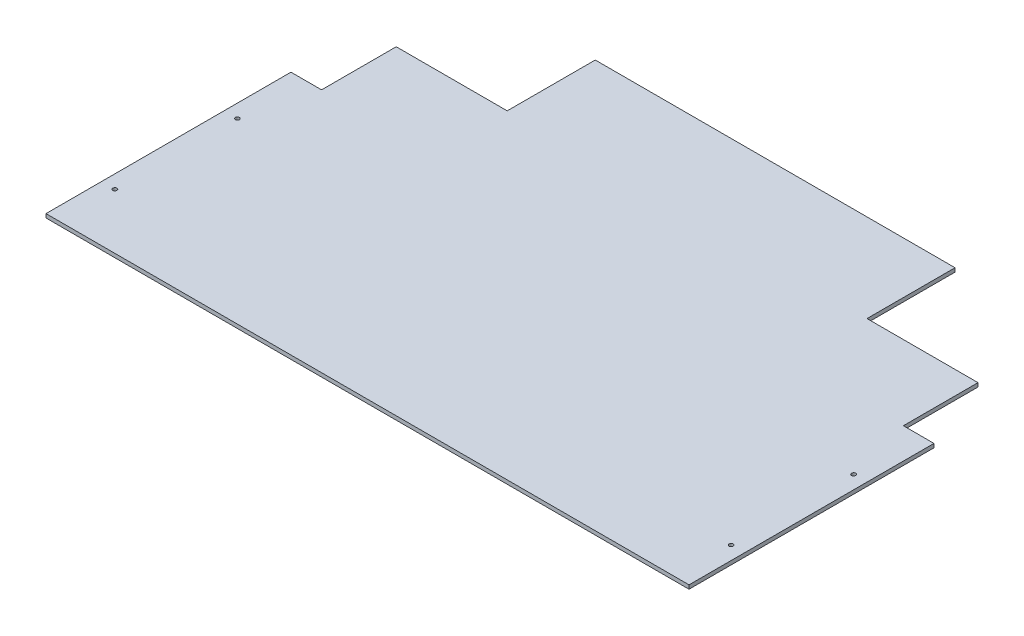
ISO-10303-21;
HEADER;
FILE_DESCRIPTION(('STEP AP214'),'2;1');
FILE_NAME('part.step','',(''),(''),'','','');
FILE_SCHEMA(('AUTOMOTIVE_DESIGN { 1 0 10303 214 1 1 1 1 }'));
ENDSEC;
DATA;
#1=APPLICATION_CONTEXT('core data for automotive mechanical design processes');
#2=APPLICATION_PROTOCOL_DEFINITION('international standard','automotive_design',2000,#1);
#3=PRODUCT_CONTEXT('',#1,'mechanical');
#4=PRODUCT('Part','Part','',(#3));
#5=PRODUCT_RELATED_PRODUCT_CATEGORY('part','',(#4));
#6=PRODUCT_DEFINITION_FORMATION('','',#4);
#7=PRODUCT_DEFINITION_CONTEXT('part definition',#1,'design');
#8=PRODUCT_DEFINITION('design','',#6,#7);
#9=PRODUCT_DEFINITION_SHAPE('','',#8);
#10=(LENGTH_UNIT() NAMED_UNIT(*) SI_UNIT(.MILLI.,.METRE.));
#11=(NAMED_UNIT(*) PLANE_ANGLE_UNIT() SI_UNIT($,.RADIAN.));
#12=(NAMED_UNIT(*) SI_UNIT($,.STERADIAN.) SOLID_ANGLE_UNIT());
#13=UNCERTAINTY_MEASURE_WITH_UNIT(LENGTH_MEASURE(1.E-05),#10,'distance_accuracy_value','');
#14=(GEOMETRIC_REPRESENTATION_CONTEXT(3) GLOBAL_UNCERTAINTY_ASSIGNED_CONTEXT((#13)) GLOBAL_UNIT_ASSIGNED_CONTEXT((#10,
#11,#12)) REPRESENTATION_CONTEXT('',''));
#15=CARTESIAN_POINT('',(0.,0.,0.));
#16=DIRECTION('',(0.,0.,1.));
#17=DIRECTION('',(1.,0.,0.));
#18=AXIS2_PLACEMENT_3D('',#15,#16,#17);
#19=CARTESIAN_POINT('',(0.,6.35,0.));
#20=DIRECTION('',(0.,-1.,0.));
#21=DIRECTION('',(0.,0.,-1.));
#22=AXIS2_PLACEMENT_3D('',#19,#20,#21);
#23=PLANE('',#22);
#24=DIRECTION('',(0.,0.,1.));
#25=VECTOR('',#24,1.);
#26=CARTESIAN_POINT('',(0.,6.35,0.));
#27=LINE('',#26,#25);
#28=CARTESIAN_POINT('',(0.,6.35,-406.4));
#29=VERTEX_POINT('',#28);
#30=CARTESIAN_POINT('',(0.,6.35,0.));
#31=VERTEX_POINT('',#30);
#32=EDGE_CURVE('E181',#29,#31,#27,.T.);
#33=ORIENTED_EDGE('',*,*,#32,.T.);
#34=DIRECTION('',(1.,0.,0.));
#35=VECTOR('',#34,1.);
#36=CARTESIAN_POINT('',(0.,6.35,0.));
#37=LINE('',#36,#35);
#38=CARTESIAN_POINT('',(1066.8,6.35,0.));
#39=VERTEX_POINT('',#38);
#40=EDGE_CURVE('E109',#31,#39,#37,.T.);
#41=ORIENTED_EDGE('',*,*,#40,.T.);
#42=DIRECTION('',(0.,0.,-1.));
#43=VECTOR('',#42,1.);
#44=CARTESIAN_POINT('',(1066.8,6.35,0.));
#45=LINE('',#44,#43);
#46=CARTESIAN_POINT('',(1066.8,6.35,-406.4));
#47=VERTEX_POINT('',#46);
#48=EDGE_CURVE('E208',#39,#47,#45,.T.);
#49=ORIENTED_EDGE('',*,*,#48,.T.);
#50=DIRECTION('',(-1.,0.,0.));
#51=VECTOR('',#50,1.);
#52=CARTESIAN_POINT('',(1016.,6.35,-406.4));
#53=LINE('',#52,#51);
#54=CARTESIAN_POINT('',(1016.,6.35,-406.4));
#55=VERTEX_POINT('',#54);
#56=EDGE_CURVE('E227',#47,#55,#53,.T.);
#57=ORIENTED_EDGE('',*,*,#56,.T.);
#58=DIRECTION('',(0.,0.,-1.));
#59=VECTOR('',#58,1.);
#60=CARTESIAN_POINT('',(1016.,6.35,-406.4));
#61=LINE('',#60,#59);
#62=CARTESIAN_POINT('',(1016.,6.35,-530.225));
#63=VERTEX_POINT('',#62);
#64=EDGE_CURVE('E224',#55,#63,#61,.T.);
#65=ORIENTED_EDGE('',*,*,#64,.T.);
#66=DIRECTION('',(-1.,0.,0.));
#67=VECTOR('',#66,1.);
#68=CARTESIAN_POINT('',(831.85,6.35,-530.225));
#69=LINE('',#68,#67);
#70=CARTESIAN_POINT('',(831.85,6.35,-530.225));
#71=VERTEX_POINT('',#70);
#72=EDGE_CURVE('E226',#63,#71,#69,.T.);
#73=ORIENTED_EDGE('',*,*,#72,.T.);
#74=DIRECTION('',(0.,0.,-1.));
#75=VECTOR('',#74,1.);
#76=CARTESIAN_POINT('',(831.85,6.35,-530.225));
#77=LINE('',#76,#75);
#78=CARTESIAN_POINT('',(831.85,6.35,-676.275));
#79=VERTEX_POINT('',#78);
#80=EDGE_CURVE('E229',#71,#79,#77,.T.);
#81=ORIENTED_EDGE('',*,*,#80,.T.);
#82=DIRECTION('',(-1.,0.,0.));
#83=VECTOR('',#82,1.);
#84=CARTESIAN_POINT('',(234.95,6.35,-676.275));
#85=LINE('',#84,#83);
#86=CARTESIAN_POINT('',(234.95,6.35,-676.275));
#87=VERTEX_POINT('',#86);
#88=EDGE_CURVE('E235',#79,#87,#85,.T.);
#89=ORIENTED_EDGE('',*,*,#88,.T.);
#90=DIRECTION('',(0.,0.,1.));
#91=VECTOR('',#90,1.);
#92=CARTESIAN_POINT('',(234.95,6.35,-530.225));
#93=LINE('',#92,#91);
#94=CARTESIAN_POINT('',(234.95,6.35,-530.225));
#95=VERTEX_POINT('',#94);
#96=EDGE_CURVE('E140',#87,#95,#93,.T.);
#97=ORIENTED_EDGE('',*,*,#96,.T.);
#98=DIRECTION('',(-1.,0.,0.));
#99=VECTOR('',#98,1.);
#100=CARTESIAN_POINT('',(234.95,6.35,-530.225));
#101=LINE('',#100,#99);
#102=CARTESIAN_POINT('',(50.8,6.35,-530.225));
#103=VERTEX_POINT('',#102);
#104=EDGE_CURVE('E134',#95,#103,#101,.T.);
#105=ORIENTED_EDGE('',*,*,#104,.T.);
#106=DIRECTION('',(0.,0.,1.));
#107=VECTOR('',#106,1.);
#108=CARTESIAN_POINT('',(50.8,6.35,-406.4));
#109=LINE('',#108,#107);
#110=CARTESIAN_POINT('',(50.8,6.35,-406.4));
#111=VERTEX_POINT('',#110);
#112=EDGE_CURVE('E138',#103,#111,#109,.T.);
#113=ORIENTED_EDGE('',*,*,#112,.T.);
#114=DIRECTION('',(-1.,0.,0.));
#115=VECTOR('',#114,1.);
#116=CARTESIAN_POINT('',(0.,6.35,-406.4));
#117=LINE('',#116,#115);
#118=EDGE_CURVE('E54',#111,#29,#117,.T.);
#119=ORIENTED_EDGE('',*,*,#118,.T.);
#120=EDGE_LOOP('',(#33,#41,#49,#57,#65,#73,#81,#89,#97,#105,#113,#119));
#121=FACE_BOUND('',#120,.T.);
#122=CARTESIAN_POINT('',(22.225,6.35,-295.275));
#123=DIRECTION('',(0.,1.,0.));
#124=DIRECTION('',(0.,0.,1.));
#125=AXIS2_PLACEMENT_3D('',#122,#123,#124);
#126=CIRCLE('',#125,3.3734375);
#127=CARTESIAN_POINT('',(22.225,6.35,-291.9015625));
#128=VERTEX_POINT('',#127);
#129=EDGE_CURVE('E162',#128,#128,#126,.T.);
#130=ORIENTED_EDGE('',*,*,#129,.F.);
#131=EDGE_LOOP('',(#130));
#132=FACE_BOUND('',#131,.T.);
#133=CARTESIAN_POINT('',(22.225,6.35,-92.075));
#134=DIRECTION('',(0.,1.,0.));
#135=DIRECTION('',(0.,0.,1.));
#136=AXIS2_PLACEMENT_3D('',#133,#134,#135);
#137=CIRCLE('',#136,3.3734375);
#138=CARTESIAN_POINT('',(22.225,6.35,-88.7015625));
#139=VERTEX_POINT('',#138);
#140=EDGE_CURVE('E299',#139,#139,#137,.T.);
#141=ORIENTED_EDGE('',*,*,#140,.F.);
#142=EDGE_LOOP('',(#141));
#143=FACE_BOUND('',#142,.T.);
#144=CARTESIAN_POINT('',(1044.575,6.35,-92.075));
#145=DIRECTION('',(0.,1.,0.));
#146=DIRECTION('',(0.,0.,1.));
#147=AXIS2_PLACEMENT_3D('',#144,#145,#146);
#148=CIRCLE('',#147,3.37343750000014);
#149=CARTESIAN_POINT('',(1044.575,6.35,-88.7015624999998));
#150=VERTEX_POINT('',#149);
#151=EDGE_CURVE('E293',#150,#150,#148,.T.);
#152=ORIENTED_EDGE('',*,*,#151,.F.);
#153=EDGE_LOOP('',(#152));
#154=FACE_BOUND('',#153,.T.);
#155=CARTESIAN_POINT('',(1044.575,6.35,-295.275));
#156=DIRECTION('',(0.,1.,0.));
#157=DIRECTION('',(0.,0.,1.));
#158=AXIS2_PLACEMENT_3D('',#155,#156,#157);
#159=CIRCLE('',#158,3.37343750000014);
#160=CARTESIAN_POINT('',(1044.575,6.35,-291.9015625));
#161=VERTEX_POINT('',#160);
#162=EDGE_CURVE('E284',#161,#161,#159,.T.);
#163=ORIENTED_EDGE('',*,*,#162,.F.);
#164=EDGE_LOOP('',(#163));
#165=FACE_BOUND('',#164,.T.);
#166=ADVANCED_FACE('F37',(#121,#132,#143,#154,#165),#23,.F.);
#167=CARTESIAN_POINT('',(0.,0.,0.));
#168=DIRECTION('',(0.,-1.,0.));
#169=DIRECTION('',(0.,0.,-1.));
#170=AXIS2_PLACEMENT_3D('',#167,#168,#169);
#171=PLANE('',#170);
#172=CARTESIAN_POINT('',(1044.575,0.,-92.075));
#173=DIRECTION('',(0.,1.,0.));
#174=DIRECTION('',(0.,0.,1.));
#175=AXIS2_PLACEMENT_3D('',#172,#173,#174);
#176=CIRCLE('',#175,3.37343750000014);
#177=CARTESIAN_POINT('',(1044.575,0.,-88.7015624999998));
#178=VERTEX_POINT('',#177);
#179=EDGE_CURVE('E290',#178,#178,#176,.T.);
#180=ORIENTED_EDGE('',*,*,#179,.T.);
#181=EDGE_LOOP('',(#180));
#182=FACE_BOUND('',#181,.T.);
#183=CARTESIAN_POINT('',(22.225,0.,-295.275));
#184=DIRECTION('',(0.,1.,0.));
#185=DIRECTION('',(0.,0.,1.));
#186=AXIS2_PLACEMENT_3D('',#183,#184,#185);
#187=CIRCLE('',#186,3.3734375);
#188=CARTESIAN_POINT('',(22.225,0.,-291.9015625));
#189=VERTEX_POINT('',#188);
#190=EDGE_CURVE('E302',#189,#189,#187,.T.);
#191=ORIENTED_EDGE('',*,*,#190,.T.);
#192=EDGE_LOOP('',(#191));
#193=FACE_BOUND('',#192,.T.);
#194=DIRECTION('',(0.,0.,1.));
#195=VECTOR('',#194,1.);
#196=CARTESIAN_POINT('',(0.,0.,0.));
#197=LINE('',#196,#195);
#198=CARTESIAN_POINT('',(0.,0.,-406.4));
#199=VERTEX_POINT('',#198);
#200=CARTESIAN_POINT('',(0.,0.,0.));
#201=VERTEX_POINT('',#200);
#202=EDGE_CURVE('E158',#199,#201,#197,.T.);
#203=ORIENTED_EDGE('',*,*,#202,.F.);
#204=DIRECTION('',(-1.,0.,0.));
#205=VECTOR('',#204,1.);
#206=CARTESIAN_POINT('',(0.,0.,-406.4));
#207=LINE('',#206,#205);
#208=CARTESIAN_POINT('',(50.8,0.,-406.4));
#209=VERTEX_POINT('',#208);
#210=EDGE_CURVE('E101',#209,#199,#207,.T.);
#211=ORIENTED_EDGE('',*,*,#210,.F.);
#212=DIRECTION('',(0.,0.,1.));
#213=VECTOR('',#212,1.);
#214=CARTESIAN_POINT('',(50.8,0.,-406.4));
#215=LINE('',#214,#213);
#216=CARTESIAN_POINT('',(50.8,0.,-530.225));
#217=VERTEX_POINT('',#216);
#218=EDGE_CURVE('E95',#217,#209,#215,.T.);
#219=ORIENTED_EDGE('',*,*,#218,.F.);
#220=DIRECTION('',(-1.,0.,0.));
#221=VECTOR('',#220,1.);
#222=CARTESIAN_POINT('',(234.95,0.,-530.225));
#223=LINE('',#222,#221);
#224=CARTESIAN_POINT('',(234.95,0.,-530.225));
#225=VERTEX_POINT('',#224);
#226=EDGE_CURVE('E148',#225,#217,#223,.T.);
#227=ORIENTED_EDGE('',*,*,#226,.F.);
#228=DIRECTION('',(0.,0.,1.));
#229=VECTOR('',#228,1.);
#230=CARTESIAN_POINT('',(234.95,0.,-530.225));
#231=LINE('',#230,#229);
#232=CARTESIAN_POINT('',(234.95,0.,-676.275));
#233=VERTEX_POINT('',#232);
#234=EDGE_CURVE('E176',#233,#225,#231,.T.);
#235=ORIENTED_EDGE('',*,*,#234,.F.);
#236=DIRECTION('',(-1.,0.,0.));
#237=VECTOR('',#236,1.);
#238=CARTESIAN_POINT('',(234.95,0.,-676.275));
#239=LINE('',#238,#237);
#240=CARTESIAN_POINT('',(831.85,0.,-676.275));
#241=VERTEX_POINT('',#240);
#242=EDGE_CURVE('E174',#241,#233,#239,.T.);
#243=ORIENTED_EDGE('',*,*,#242,.F.);
#244=DIRECTION('',(0.,0.,-1.));
#245=VECTOR('',#244,1.);
#246=CARTESIAN_POINT('',(831.85,0.,-530.225));
#247=LINE('',#246,#245);
#248=CARTESIAN_POINT('',(831.85,0.,-530.225));
#249=VERTEX_POINT('',#248);
#250=EDGE_CURVE('E172',#249,#241,#247,.T.);
#251=ORIENTED_EDGE('',*,*,#250,.F.);
#252=DIRECTION('',(-1.,0.,0.));
#253=VECTOR('',#252,1.);
#254=CARTESIAN_POINT('',(831.85,0.,-530.225));
#255=LINE('',#254,#253);
#256=CARTESIAN_POINT('',(1016.,0.,-530.225));
#257=VERTEX_POINT('',#256);
#258=EDGE_CURVE('E170',#257,#249,#255,.T.);
#259=ORIENTED_EDGE('',*,*,#258,.F.);
#260=DIRECTION('',(0.,0.,-1.));
#261=VECTOR('',#260,1.);
#262=CARTESIAN_POINT('',(1016.,0.,-406.4));
#263=LINE('',#262,#261);
#264=CARTESIAN_POINT('',(1016.,0.,-406.4));
#265=VERTEX_POINT('',#264);
#266=EDGE_CURVE('E168',#265,#257,#263,.T.);
#267=ORIENTED_EDGE('',*,*,#266,.F.);
#268=DIRECTION('',(-1.,0.,0.));
#269=VECTOR('',#268,1.);
#270=CARTESIAN_POINT('',(1016.,0.,-406.4));
#271=LINE('',#270,#269);
#272=CARTESIAN_POINT('',(1066.8,0.,-406.4));
#273=VERTEX_POINT('',#272);
#274=EDGE_CURVE('E166',#273,#265,#271,.T.);
#275=ORIENTED_EDGE('',*,*,#274,.F.);
#276=DIRECTION('',(0.,0.,-1.));
#277=VECTOR('',#276,1.);
#278=CARTESIAN_POINT('',(1066.8,0.,0.));
#279=LINE('',#278,#277);
#280=CARTESIAN_POINT('',(1066.8,0.,0.));
#281=VERTEX_POINT('',#280);
#282=EDGE_CURVE('E164',#281,#273,#279,.T.);
#283=ORIENTED_EDGE('',*,*,#282,.F.);
#284=DIRECTION('',(1.,0.,0.));
#285=VECTOR('',#284,1.);
#286=CARTESIAN_POINT('',(0.,0.,0.));
#287=LINE('',#286,#285);
#288=EDGE_CURVE('E161',#201,#281,#287,.T.);
#289=ORIENTED_EDGE('',*,*,#288,.F.);
#290=EDGE_LOOP('',(#203,#211,#219,#227,#235,#243,#251,#259,#267,#275,#283,#289));
#291=FACE_BOUND('',#290,.T.);
#292=CARTESIAN_POINT('',(22.225,0.,-92.075));
#293=DIRECTION('',(0.,1.,0.));
#294=DIRECTION('',(0.,0.,1.));
#295=AXIS2_PLACEMENT_3D('',#292,#293,#294);
#296=CIRCLE('',#295,3.3734375);
#297=CARTESIAN_POINT('',(22.225,0.,-88.7015625));
#298=VERTEX_POINT('',#297);
#299=EDGE_CURVE('E296',#298,#298,#296,.T.);
#300=ORIENTED_EDGE('',*,*,#299,.T.);
#301=EDGE_LOOP('',(#300));
#302=FACE_BOUND('',#301,.T.);
#303=CARTESIAN_POINT('',(1044.575,0.,-295.275));
#304=DIRECTION('',(0.,1.,0.));
#305=DIRECTION('',(0.,0.,1.));
#306=AXIS2_PLACEMENT_3D('',#303,#304,#305);
#307=CIRCLE('',#306,3.37343750000014);
#308=CARTESIAN_POINT('',(1044.575,0.,-291.9015625));
#309=VERTEX_POINT('',#308);
#310=EDGE_CURVE('E287',#309,#309,#307,.T.);
#311=ORIENTED_EDGE('',*,*,#310,.T.);
#312=EDGE_LOOP('',(#311));
#313=FACE_BOUND('',#312,.T.);
#314=ADVANCED_FACE('F212',(#182,#193,#291,#302,#313),#171,.T.);
#315=CARTESIAN_POINT('',(0.,6.35,0.));
#316=DIRECTION('',(1.,0.,0.));
#317=DIRECTION('',(0.,0.,-1.));
#318=AXIS2_PLACEMENT_3D('',#315,#316,#317);
#319=PLANE('',#318);
#320=ORIENTED_EDGE('',*,*,#202,.T.);
#321=DIRECTION('',(0.,-1.,0.));
#322=VECTOR('',#321,1.);
#323=CARTESIAN_POINT('',(0.,6.35,0.));
#324=LINE('',#323,#322);
#325=EDGE_CURVE('E11',#31,#201,#324,.T.);
#326=ORIENTED_EDGE('',*,*,#325,.F.);
#327=ORIENTED_EDGE('',*,*,#32,.F.);
#328=DIRECTION('',(0.,-1.,0.));
#329=VECTOR('',#328,1.);
#330=CARTESIAN_POINT('',(0.,6.35,-406.4));
#331=LINE('',#330,#329);
#332=EDGE_CURVE('E154',#29,#199,#331,.T.);
#333=ORIENTED_EDGE('',*,*,#332,.T.);
#334=EDGE_LOOP('',(#320,#326,#327,#333));
#335=FACE_BOUND('',#334,.T.);
#336=ADVANCED_FACE('F39',(#335),#319,.F.);
#337=CARTESIAN_POINT('',(0.,6.35,0.));
#338=DIRECTION('',(0.,0.,-1.));
#339=DIRECTION('',(-1.,0.,0.));
#340=AXIS2_PLACEMENT_3D('',#337,#338,#339);
#341=PLANE('',#340);
#342=ORIENTED_EDGE('',*,*,#288,.T.);
#343=DIRECTION('',(0.,-1.,0.));
#344=VECTOR('',#343,1.);
#345=CARTESIAN_POINT('',(1066.8,6.35,0.));
#346=LINE('',#345,#344);
#347=EDGE_CURVE('E46',#39,#281,#346,.T.);
#348=ORIENTED_EDGE('',*,*,#347,.F.);
#349=ORIENTED_EDGE('',*,*,#40,.F.);
#350=ORIENTED_EDGE('',*,*,#325,.T.);
#351=EDGE_LOOP('',(#342,#348,#349,#350));
#352=FACE_BOUND('',#351,.T.);
#353=ADVANCED_FACE('F424',(#352),#341,.F.);
#354=CARTESIAN_POINT('',(1066.8,6.35,0.));
#355=DIRECTION('',(-1.,0.,0.));
#356=DIRECTION('',(0.,0.,1.));
#357=AXIS2_PLACEMENT_3D('',#354,#355,#356);
#358=PLANE('',#357);
#359=ORIENTED_EDGE('',*,*,#282,.T.);
#360=DIRECTION('',(0.,-1.,0.));
#361=VECTOR('',#360,1.);
#362=CARTESIAN_POINT('',(1066.8,6.35,-406.4));
#363=LINE('',#362,#361);
#364=EDGE_CURVE('E200',#47,#273,#363,.T.);
#365=ORIENTED_EDGE('',*,*,#364,.F.);
#366=ORIENTED_EDGE('',*,*,#48,.F.);
#367=ORIENTED_EDGE('',*,*,#347,.T.);
#368=EDGE_LOOP('',(#359,#365,#366,#367));
#369=FACE_BOUND('',#368,.T.);
#370=ADVANCED_FACE('F206',(#369),#358,.F.);
#371=CARTESIAN_POINT('',(1016.,6.35,-406.4));
#372=DIRECTION('',(0.,0.,1.));
#373=DIRECTION('',(1.,0.,0.));
#374=AXIS2_PLACEMENT_3D('',#371,#372,#373);
#375=PLANE('',#374);
#376=ORIENTED_EDGE('',*,*,#274,.T.);
#377=DIRECTION('',(0.,-1.,0.));
#378=VECTOR('',#377,1.);
#379=CARTESIAN_POINT('',(1016.,6.35,-406.4));
#380=LINE('',#379,#378);
#381=EDGE_CURVE('E197',#55,#265,#380,.T.);
#382=ORIENTED_EDGE('',*,*,#381,.F.);
#383=ORIENTED_EDGE('',*,*,#56,.F.);
#384=ORIENTED_EDGE('',*,*,#364,.T.);
#385=EDGE_LOOP('',(#376,#382,#383,#384));
#386=FACE_BOUND('',#385,.T.);
#387=ADVANCED_FACE('F218',(#386),#375,.F.);
#388=CARTESIAN_POINT('',(1016.,6.35,-406.4));
#389=DIRECTION('',(-1.,0.,0.));
#390=DIRECTION('',(0.,0.,1.));
#391=AXIS2_PLACEMENT_3D('',#388,#389,#390);
#392=PLANE('',#391);
#393=ORIENTED_EDGE('',*,*,#266,.T.);
#394=DIRECTION('',(0.,-1.,0.));
#395=VECTOR('',#394,1.);
#396=CARTESIAN_POINT('',(1016.,6.35,-530.225));
#397=LINE('',#396,#395);
#398=EDGE_CURVE('E194',#63,#257,#397,.T.);
#399=ORIENTED_EDGE('',*,*,#398,.F.);
#400=ORIENTED_EDGE('',*,*,#64,.F.);
#401=ORIENTED_EDGE('',*,*,#381,.T.);
#402=EDGE_LOOP('',(#393,#399,#400,#401));
#403=FACE_BOUND('',#402,.T.);
#404=ADVANCED_FACE('F222',(#403),#392,.F.);
#405=CARTESIAN_POINT('',(831.85,6.35,-530.225));
#406=DIRECTION('',(0.,0.,1.));
#407=DIRECTION('',(1.,0.,0.));
#408=AXIS2_PLACEMENT_3D('',#405,#406,#407);
#409=PLANE('',#408);
#410=ORIENTED_EDGE('',*,*,#258,.T.);
#411=DIRECTION('',(0.,-1.,0.));
#412=VECTOR('',#411,1.);
#413=CARTESIAN_POINT('',(831.85,6.35,-530.225));
#414=LINE('',#413,#412);
#415=EDGE_CURVE('E191',#71,#249,#414,.T.);
#416=ORIENTED_EDGE('',*,*,#415,.F.);
#417=ORIENTED_EDGE('',*,*,#72,.F.);
#418=ORIENTED_EDGE('',*,*,#398,.T.);
#419=EDGE_LOOP('',(#410,#416,#417,#418));
#420=FACE_BOUND('',#419,.T.);
#421=ADVANCED_FACE('F385',(#420),#409,.F.);
#422=CARTESIAN_POINT('',(831.85,6.35,-530.225));
#423=DIRECTION('',(-1.,0.,0.));
#424=DIRECTION('',(0.,0.,1.));
#425=AXIS2_PLACEMENT_3D('',#422,#423,#424);
#426=PLANE('',#425);
#427=ORIENTED_EDGE('',*,*,#250,.T.);
#428=DIRECTION('',(0.,-1.,0.));
#429=VECTOR('',#428,1.);
#430=CARTESIAN_POINT('',(831.85,6.35,-676.275));
#431=LINE('',#430,#429);
#432=EDGE_CURVE('E188',#79,#241,#431,.T.);
#433=ORIENTED_EDGE('',*,*,#432,.F.);
#434=ORIENTED_EDGE('',*,*,#80,.F.);
#435=ORIENTED_EDGE('',*,*,#415,.T.);
#436=EDGE_LOOP('',(#427,#433,#434,#435));
#437=FACE_BOUND('',#436,.T.);
#438=ADVANCED_FACE('F375',(#437),#426,.F.);
#439=CARTESIAN_POINT('',(234.95,6.35,-676.275));
#440=DIRECTION('',(0.,0.,1.));
#441=DIRECTION('',(1.,0.,0.));
#442=AXIS2_PLACEMENT_3D('',#439,#440,#441);
#443=PLANE('',#442);
#444=ORIENTED_EDGE('',*,*,#242,.T.);
#445=DIRECTION('',(0.,-1.,0.));
#446=VECTOR('',#445,1.);
#447=CARTESIAN_POINT('',(234.95,6.35,-676.275));
#448=LINE('',#447,#446);
#449=EDGE_CURVE('E185',#87,#233,#448,.T.);
#450=ORIENTED_EDGE('',*,*,#449,.F.);
#451=ORIENTED_EDGE('',*,*,#88,.F.);
#452=ORIENTED_EDGE('',*,*,#432,.T.);
#453=EDGE_LOOP('',(#444,#450,#451,#452));
#454=FACE_BOUND('',#453,.T.);
#455=ADVANCED_FACE('F241',(#454),#443,.F.);
#456=CARTESIAN_POINT('',(234.95,6.35,-530.225));
#457=DIRECTION('',(1.,0.,0.));
#458=DIRECTION('',(0.,0.,-1.));
#459=AXIS2_PLACEMENT_3D('',#456,#457,#458);
#460=PLANE('',#459);
#461=ORIENTED_EDGE('',*,*,#234,.T.);
#462=DIRECTION('',(0.,-1.,0.));
#463=VECTOR('',#462,1.);
#464=CARTESIAN_POINT('',(234.95,6.35,-530.225));
#465=LINE('',#464,#463);
#466=EDGE_CURVE('E149',#95,#225,#465,.T.);
#467=ORIENTED_EDGE('',*,*,#466,.F.);
#468=ORIENTED_EDGE('',*,*,#96,.F.);
#469=ORIENTED_EDGE('',*,*,#449,.T.);
#470=EDGE_LOOP('',(#461,#467,#468,#469));
#471=FACE_BOUND('',#470,.T.);
#472=ADVANCED_FACE('F245',(#471),#460,.F.);
#473=CARTESIAN_POINT('',(234.95,6.35,-530.225));
#474=DIRECTION('',(0.,0.,1.));
#475=DIRECTION('',(1.,0.,0.));
#476=AXIS2_PLACEMENT_3D('',#473,#474,#475);
#477=PLANE('',#476);
#478=ORIENTED_EDGE('',*,*,#226,.T.);
#479=DIRECTION('',(0.,-1.,0.));
#480=VECTOR('',#479,1.);
#481=CARTESIAN_POINT('',(50.8,6.35,-530.225));
#482=LINE('',#481,#480);
#483=EDGE_CURVE('E145',#103,#217,#482,.T.);
#484=ORIENTED_EDGE('',*,*,#483,.F.);
#485=ORIENTED_EDGE('',*,*,#104,.F.);
#486=ORIENTED_EDGE('',*,*,#466,.T.);
#487=EDGE_LOOP('',(#478,#484,#485,#486));
#488=FACE_BOUND('',#487,.T.);
#489=ADVANCED_FACE('F146',(#488),#477,.F.);
#490=CARTESIAN_POINT('',(50.8,6.35,-406.4));
#491=DIRECTION('',(1.,0.,0.));
#492=DIRECTION('',(0.,0.,-1.));
#493=AXIS2_PLACEMENT_3D('',#490,#491,#492);
#494=PLANE('',#493);
#495=ORIENTED_EDGE('',*,*,#218,.T.);
#496=DIRECTION('',(0.,-1.,0.));
#497=VECTOR('',#496,1.);
#498=CARTESIAN_POINT('',(50.8,6.35,-406.4));
#499=LINE('',#498,#497);
#500=EDGE_CURVE('E150',#111,#209,#499,.T.);
#501=ORIENTED_EDGE('',*,*,#500,.F.);
#502=ORIENTED_EDGE('',*,*,#112,.F.);
#503=ORIENTED_EDGE('',*,*,#483,.T.);
#504=EDGE_LOOP('',(#495,#501,#502,#503));
#505=FACE_BOUND('',#504,.T.);
#506=ADVANCED_FACE('F152',(#505),#494,.F.);
#507=CARTESIAN_POINT('',(0.,6.35,-406.4));
#508=DIRECTION('',(0.,0.,1.));
#509=DIRECTION('',(1.,0.,0.));
#510=AXIS2_PLACEMENT_3D('',#507,#508,#509);
#511=PLANE('',#510);
#512=ORIENTED_EDGE('',*,*,#210,.T.);
#513=ORIENTED_EDGE('',*,*,#332,.F.);
#514=ORIENTED_EDGE('',*,*,#118,.F.);
#515=ORIENTED_EDGE('',*,*,#500,.T.);
#516=EDGE_LOOP('',(#512,#513,#514,#515));
#517=FACE_BOUND('',#516,.T.);
#518=ADVANCED_FACE('F249',(#517),#511,.F.);
#519=CARTESIAN_POINT('',(22.225,6.35,-295.275));
#520=DIRECTION('',(0.,-1.,0.));
#521=DIRECTION('',(0.,0.,-1.));
#522=AXIS2_PLACEMENT_3D('',#519,#520,#521);
#523=CYLINDRICAL_SURFACE('',#522,3.3734375);
#524=ORIENTED_EDGE('',*,*,#129,.T.);
#525=EDGE_LOOP('',(#524));
#526=FACE_BOUND('',#525,.T.);
#527=ORIENTED_EDGE('',*,*,#190,.F.);
#528=EDGE_LOOP('',(#527));
#529=FACE_BOUND('',#528,.T.);
#530=ADVANCED_FACE('F251',(#526,#529),#523,.F.);
#531=CARTESIAN_POINT('',(22.225,6.35,-92.075));
#532=DIRECTION('',(0.,-1.,0.));
#533=DIRECTION('',(0.,0.,-1.));
#534=AXIS2_PLACEMENT_3D('',#531,#532,#533);
#535=CYLINDRICAL_SURFACE('',#534,3.3734375);
#536=ORIENTED_EDGE('',*,*,#140,.T.);
#537=EDGE_LOOP('',(#536));
#538=FACE_BOUND('',#537,.T.);
#539=ORIENTED_EDGE('',*,*,#299,.F.);
#540=EDGE_LOOP('',(#539));
#541=FACE_BOUND('',#540,.T.);
#542=ADVANCED_FACE('F257',(#538,#541),#535,.F.);
#543=CARTESIAN_POINT('',(1044.575,6.35,-92.075));
#544=DIRECTION('',(0.,-1.,0.));
#545=DIRECTION('',(0.,0.,-1.));
#546=AXIS2_PLACEMENT_3D('',#543,#544,#545);
#547=CYLINDRICAL_SURFACE('',#546,3.37343750000014);
#548=ORIENTED_EDGE('',*,*,#151,.T.);
#549=EDGE_LOOP('',(#548));
#550=FACE_BOUND('',#549,.T.);
#551=ORIENTED_EDGE('',*,*,#179,.F.);
#552=EDGE_LOOP('',(#551));
#553=FACE_BOUND('',#552,.T.);
#554=ADVANCED_FACE('F271',(#550,#553),#547,.F.);
#555=CARTESIAN_POINT('',(1044.575,6.35,-295.275));
#556=DIRECTION('',(0.,-1.,0.));
#557=DIRECTION('',(0.,0.,-1.));
#558=AXIS2_PLACEMENT_3D('',#555,#556,#557);
#559=CYLINDRICAL_SURFACE('',#558,3.37343750000014);
#560=ORIENTED_EDGE('',*,*,#162,.T.);
#561=EDGE_LOOP('',(#560));
#562=FACE_BOUND('',#561,.T.);
#563=ORIENTED_EDGE('',*,*,#310,.F.);
#564=EDGE_LOOP('',(#563));
#565=FACE_BOUND('',#564,.T.);
#566=ADVANCED_FACE('F275',(#562,#565),#559,.F.);
#567=CLOSED_SHELL('',(#166,#314,#336,#353,#370,#387,#404,#421,#438,#455,#472,#489,#506,#518,
#530,#542,#554,#566));
#568=MANIFOLD_SOLID_BREP('B2',#567);
#569=ADVANCED_BREP_SHAPE_REPRESENTATION('',(#18,#568),#14);
#570=SHAPE_DEFINITION_REPRESENTATION(#9,#569);
ENDSEC;
END-ISO-10303-21;
